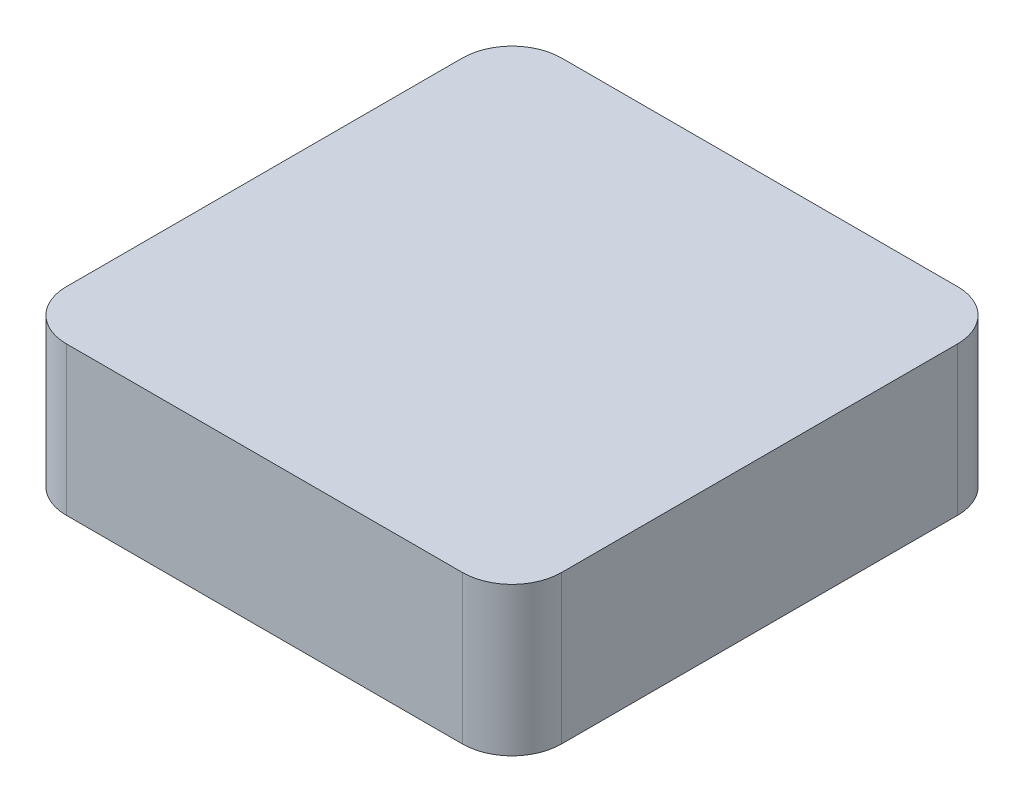
ISO-10303-21;
HEADER;
FILE_DESCRIPTION(('STEP AP214'),'2;1');
FILE_NAME('part.step','',(''),(''),'','','');
FILE_SCHEMA(('AUTOMOTIVE_DESIGN { 1 0 10303 214 1 1 1 1 }'));
ENDSEC;
DATA;
#1=APPLICATION_CONTEXT('core data for automotive mechanical design processes');
#2=APPLICATION_PROTOCOL_DEFINITION('international standard','automotive_design',2000,#1);
#3=PRODUCT_CONTEXT('',#1,'mechanical');
#4=PRODUCT('Part','Part','',(#3));
#5=PRODUCT_RELATED_PRODUCT_CATEGORY('part','',(#4));
#6=PRODUCT_DEFINITION_FORMATION('','',#4);
#7=PRODUCT_DEFINITION_CONTEXT('part definition',#1,'design');
#8=PRODUCT_DEFINITION('design','',#6,#7);
#9=PRODUCT_DEFINITION_SHAPE('','',#8);
#10=(LENGTH_UNIT() NAMED_UNIT(*) SI_UNIT(.MILLI.,.METRE.));
#11=(NAMED_UNIT(*) PLANE_ANGLE_UNIT() SI_UNIT($,.RADIAN.));
#12=(NAMED_UNIT(*) SI_UNIT($,.STERADIAN.) SOLID_ANGLE_UNIT());
#13=UNCERTAINTY_MEASURE_WITH_UNIT(LENGTH_MEASURE(1.E-05),#10,'distance_accuracy_value','');
#14=(GEOMETRIC_REPRESENTATION_CONTEXT(3) GLOBAL_UNCERTAINTY_ASSIGNED_CONTEXT((#13)) GLOBAL_UNIT_ASSIGNED_CONTEXT((#10,
#11,#12)) REPRESENTATION_CONTEXT('',''));
#15=CARTESIAN_POINT('',(0.,0.,0.));
#16=DIRECTION('',(0.,0.,1.));
#17=DIRECTION('',(1.,0.,0.));
#18=AXIS2_PLACEMENT_3D('',#15,#16,#17);
#19=CARTESIAN_POINT('',(50.8,38.1,-50.8));
#20=DIRECTION('',(0.,-1.,0.));
#21=DIRECTION('',(0.,0.,-1.));
#22=AXIS2_PLACEMENT_3D('',#19,#20,#21);
#23=CYLINDRICAL_SURFACE('',#22,12.7);
#24=CARTESIAN_POINT('',(50.8,0.,-50.8));
#25=DIRECTION('',(0.,1.,0.));
#26=DIRECTION('',(0.,0.,-1.));
#27=AXIS2_PLACEMENT_3D('',#24,#25,#26);
#28=CIRCLE('',#27,12.7);
#29=CARTESIAN_POINT('',(63.5,0.,-50.8));
#30=VERTEX_POINT('',#29);
#31=CARTESIAN_POINT('',(50.8,0.,-63.5));
#32=VERTEX_POINT('',#31);
#33=EDGE_CURVE('E129',#30,#32,#28,.T.);
#34=ORIENTED_EDGE('',*,*,#33,.T.);
#35=DIRECTION('',(0.,-1.,0.));
#36=VECTOR('',#35,1.);
#37=CARTESIAN_POINT('',(50.8,38.1,-63.5));
#38=LINE('',#37,#36);
#39=CARTESIAN_POINT('',(50.8,38.1,-63.5));
#40=VERTEX_POINT('',#39);
#41=EDGE_CURVE('E11',#40,#32,#38,.T.);
#42=ORIENTED_EDGE('',*,*,#41,.F.);
#43=CARTESIAN_POINT('',(50.8,38.1,-50.8));
#44=DIRECTION('',(0.,1.,0.));
#45=DIRECTION('',(0.,0.,-1.));
#46=AXIS2_PLACEMENT_3D('',#43,#44,#45);
#47=CIRCLE('',#46,12.7);
#48=CARTESIAN_POINT('',(63.5,38.1,-50.8));
#49=VERTEX_POINT('',#48);
#50=EDGE_CURVE('E143',#49,#40,#47,.T.);
#51=ORIENTED_EDGE('',*,*,#50,.F.);
#52=DIRECTION('',(0.,-1.,0.));
#53=VECTOR('',#52,1.);
#54=CARTESIAN_POINT('',(63.5,38.1,-50.8));
#55=LINE('',#54,#53);
#56=EDGE_CURVE('E125',#49,#30,#55,.T.);
#57=ORIENTED_EDGE('',*,*,#56,.T.);
#58=EDGE_LOOP('',(#34,#42,#51,#57));
#59=FACE_BOUND('',#58,.T.);
#60=ADVANCED_FACE('F33',(#59),#23,.T.);
#61=CARTESIAN_POINT('',(-50.8,38.1,-63.5));
#62=DIRECTION('',(0.,0.,1.));
#63=DIRECTION('',(1.,0.,0.));
#64=AXIS2_PLACEMENT_3D('',#61,#62,#63);
#65=PLANE('',#64);
#66=DIRECTION('',(-1.,0.,0.));
#67=VECTOR('',#66,1.);
#68=CARTESIAN_POINT('',(-50.8,0.,-63.5));
#69=LINE('',#68,#67);
#70=CARTESIAN_POINT('',(-50.8,0.,-63.5));
#71=VERTEX_POINT('',#70);
#72=EDGE_CURVE('E132',#32,#71,#69,.T.);
#73=ORIENTED_EDGE('',*,*,#72,.T.);
#74=DIRECTION('',(0.,-1.,0.));
#75=VECTOR('',#74,1.);
#76=CARTESIAN_POINT('',(-50.8,38.1,-63.5));
#77=LINE('',#76,#75);
#78=CARTESIAN_POINT('',(-50.8,38.1,-63.5));
#79=VERTEX_POINT('',#78);
#80=EDGE_CURVE('E41',#79,#71,#77,.T.);
#81=ORIENTED_EDGE('',*,*,#80,.F.);
#82=DIRECTION('',(-1.,0.,0.));
#83=VECTOR('',#82,1.);
#84=CARTESIAN_POINT('',(-50.8,38.1,-63.5));
#85=LINE('',#84,#83);
#86=EDGE_CURVE('E92',#40,#79,#85,.T.);
#87=ORIENTED_EDGE('',*,*,#86,.F.);
#88=ORIENTED_EDGE('',*,*,#41,.T.);
#89=EDGE_LOOP('',(#73,#81,#87,#88));
#90=FACE_BOUND('',#89,.T.);
#91=ADVANCED_FACE('F178',(#90),#65,.F.);
#92=CARTESIAN_POINT('',(-50.8,38.1,-50.8));
#93=DIRECTION('',(0.,-1.,0.));
#94=DIRECTION('',(0.,0.,-1.));
#95=AXIS2_PLACEMENT_3D('',#92,#93,#94);
#96=CYLINDRICAL_SURFACE('',#95,12.7);
#97=CARTESIAN_POINT('',(-50.8,0.,-50.8));
#98=DIRECTION('',(0.,1.,0.));
#99=DIRECTION('',(0.,0.,-1.));
#100=AXIS2_PLACEMENT_3D('',#97,#98,#99);
#101=CIRCLE('',#100,12.7);
#102=CARTESIAN_POINT('',(-63.5,0.,-50.8));
#103=VERTEX_POINT('',#102);
#104=EDGE_CURVE('E134',#71,#103,#101,.T.);
#105=ORIENTED_EDGE('',*,*,#104,.T.);
#106=DIRECTION('',(0.,-1.,0.));
#107=VECTOR('',#106,1.);
#108=CARTESIAN_POINT('',(-63.5,38.1,-50.8));
#109=LINE('',#108,#107);
#110=CARTESIAN_POINT('',(-63.5,38.1,-50.8));
#111=VERTEX_POINT('',#110);
#112=EDGE_CURVE('E150',#111,#103,#109,.T.);
#113=ORIENTED_EDGE('',*,*,#112,.F.);
#114=CARTESIAN_POINT('',(-50.8,38.1,-50.8));
#115=DIRECTION('',(0.,1.,0.));
#116=DIRECTION('',(0.,0.,-1.));
#117=AXIS2_PLACEMENT_3D('',#114,#115,#116);
#118=CIRCLE('',#117,12.7);
#119=EDGE_CURVE('E158',#79,#111,#118,.T.);
#120=ORIENTED_EDGE('',*,*,#119,.F.);
#121=ORIENTED_EDGE('',*,*,#80,.T.);
#122=EDGE_LOOP('',(#105,#113,#120,#121));
#123=FACE_BOUND('',#122,.T.);
#124=ADVANCED_FACE('F156',(#123),#96,.T.);
#125=CARTESIAN_POINT('',(-63.5,38.1,50.8));
#126=DIRECTION('',(1.,0.,0.));
#127=DIRECTION('',(0.,0.,-1.));
#128=AXIS2_PLACEMENT_3D('',#125,#126,#127);
#129=PLANE('',#128);
#130=DIRECTION('',(0.,0.,1.));
#131=VECTOR('',#130,1.);
#132=CARTESIAN_POINT('',(-63.5,0.,50.8));
#133=LINE('',#132,#131);
#134=CARTESIAN_POINT('',(-63.5,0.,50.8));
#135=VERTEX_POINT('',#134);
#136=EDGE_CURVE('E136',#103,#135,#133,.T.);
#137=ORIENTED_EDGE('',*,*,#136,.T.);
#138=DIRECTION('',(0.,-1.,0.));
#139=VECTOR('',#138,1.);
#140=CARTESIAN_POINT('',(-63.5,38.1,50.8));
#141=LINE('',#140,#139);
#142=CARTESIAN_POINT('',(-63.5,38.1,50.8));
#143=VERTEX_POINT('',#142);
#144=EDGE_CURVE('E147',#143,#135,#141,.T.);
#145=ORIENTED_EDGE('',*,*,#144,.F.);
#146=DIRECTION('',(0.,0.,1.));
#147=VECTOR('',#146,1.);
#148=CARTESIAN_POINT('',(-63.5,38.1,50.8));
#149=LINE('',#148,#147);
#150=EDGE_CURVE('E170',#111,#143,#149,.T.);
#151=ORIENTED_EDGE('',*,*,#150,.F.);
#152=ORIENTED_EDGE('',*,*,#112,.T.);
#153=EDGE_LOOP('',(#137,#145,#151,#152));
#154=FACE_BOUND('',#153,.T.);
#155=ADVANCED_FACE('F166',(#154),#129,.F.);
#156=CARTESIAN_POINT('',(-50.8,38.1,50.8));
#157=DIRECTION('',(0.,-1.,0.));
#158=DIRECTION('',(0.,0.,-1.));
#159=AXIS2_PLACEMENT_3D('',#156,#157,#158);
#160=CYLINDRICAL_SURFACE('',#159,12.7);
#161=CARTESIAN_POINT('',(-50.8,0.,50.8));
#162=DIRECTION('',(0.,1.,0.));
#163=DIRECTION('',(0.,0.,-1.));
#164=AXIS2_PLACEMENT_3D('',#161,#162,#163);
#165=CIRCLE('',#164,12.7);
#166=CARTESIAN_POINT('',(-50.8,0.,63.5));
#167=VERTEX_POINT('',#166);
#168=EDGE_CURVE('E138',#135,#167,#165,.T.);
#169=ORIENTED_EDGE('',*,*,#168,.T.);
#170=DIRECTION('',(0.,-1.,0.));
#171=VECTOR('',#170,1.);
#172=CARTESIAN_POINT('',(-50.8,38.1,63.5));
#173=LINE('',#172,#171);
#174=CARTESIAN_POINT('',(-50.8,38.1,63.5));
#175=VERTEX_POINT('',#174);
#176=EDGE_CURVE('E120',#175,#167,#173,.T.);
#177=ORIENTED_EDGE('',*,*,#176,.F.);
#178=CARTESIAN_POINT('',(-50.8,38.1,50.8));
#179=DIRECTION('',(0.,1.,0.));
#180=DIRECTION('',(0.,0.,-1.));
#181=AXIS2_PLACEMENT_3D('',#178,#179,#180);
#182=CIRCLE('',#181,12.7);
#183=EDGE_CURVE('E111',#143,#175,#182,.T.);
#184=ORIENTED_EDGE('',*,*,#183,.F.);
#185=ORIENTED_EDGE('',*,*,#144,.T.);
#186=EDGE_LOOP('',(#169,#177,#184,#185));
#187=FACE_BOUND('',#186,.T.);
#188=ADVANCED_FACE('F169',(#187),#160,.T.);
#189=CARTESIAN_POINT('',(-50.8,38.1,63.5));
#190=DIRECTION('',(0.,0.,-1.));
#191=DIRECTION('',(-1.,0.,0.));
#192=AXIS2_PLACEMENT_3D('',#189,#190,#191);
#193=PLANE('',#192);
#194=DIRECTION('',(1.,0.,0.));
#195=VECTOR('',#194,1.);
#196=CARTESIAN_POINT('',(-50.8,0.,63.5));
#197=LINE('',#196,#195);
#198=CARTESIAN_POINT('',(50.8,0.,63.5));
#199=VERTEX_POINT('',#198);
#200=EDGE_CURVE('E119',#167,#199,#197,.T.);
#201=ORIENTED_EDGE('',*,*,#200,.T.);
#202=DIRECTION('',(0.,-1.,0.));
#203=VECTOR('',#202,1.);
#204=CARTESIAN_POINT('',(50.8,38.1,63.5));
#205=LINE('',#204,#203);
#206=CARTESIAN_POINT('',(50.8,38.1,63.5));
#207=VERTEX_POINT('',#206);
#208=EDGE_CURVE('E116',#207,#199,#205,.T.);
#209=ORIENTED_EDGE('',*,*,#208,.F.);
#210=DIRECTION('',(1.,0.,0.));
#211=VECTOR('',#210,1.);
#212=CARTESIAN_POINT('',(-50.8,38.1,63.5));
#213=LINE('',#212,#211);
#214=EDGE_CURVE('E105',#175,#207,#213,.T.);
#215=ORIENTED_EDGE('',*,*,#214,.F.);
#216=ORIENTED_EDGE('',*,*,#176,.T.);
#217=EDGE_LOOP('',(#201,#209,#215,#216));
#218=FACE_BOUND('',#217,.T.);
#219=ADVANCED_FACE('F117',(#218),#193,.F.);
#220=CARTESIAN_POINT('',(50.8,38.1,50.8));
#221=DIRECTION('',(0.,-1.,0.));
#222=DIRECTION('',(0.,0.,-1.));
#223=AXIS2_PLACEMENT_3D('',#220,#221,#222);
#224=CYLINDRICAL_SURFACE('',#223,12.7);
#225=CARTESIAN_POINT('',(50.8,0.,50.8));
#226=DIRECTION('',(0.,1.,0.));
#227=DIRECTION('',(0.,0.,1.));
#228=AXIS2_PLACEMENT_3D('',#225,#226,#227);
#229=CIRCLE('',#228,12.7);
#230=CARTESIAN_POINT('',(63.5,0.,50.8));
#231=VERTEX_POINT('',#230);
#232=EDGE_CURVE('E78',#199,#231,#229,.T.);
#233=ORIENTED_EDGE('',*,*,#232,.T.);
#234=DIRECTION('',(0.,-1.,0.));
#235=VECTOR('',#234,1.);
#236=CARTESIAN_POINT('',(63.5,38.1,50.8));
#237=LINE('',#236,#235);
#238=CARTESIAN_POINT('',(63.5,38.1,50.8));
#239=VERTEX_POINT('',#238);
#240=EDGE_CURVE('E121',#239,#231,#237,.T.);
#241=ORIENTED_EDGE('',*,*,#240,.F.);
#242=CARTESIAN_POINT('',(50.8,38.1,50.8));
#243=DIRECTION('',(0.,1.,0.));
#244=DIRECTION('',(0.,0.,1.));
#245=AXIS2_PLACEMENT_3D('',#242,#243,#244);
#246=CIRCLE('',#245,12.7);
#247=EDGE_CURVE('E109',#207,#239,#246,.T.);
#248=ORIENTED_EDGE('',*,*,#247,.F.);
#249=ORIENTED_EDGE('',*,*,#208,.T.);
#250=EDGE_LOOP('',(#233,#241,#248,#249));
#251=FACE_BOUND('',#250,.T.);
#252=ADVANCED_FACE('F123',(#251),#224,.T.);
#253=CARTESIAN_POINT('',(63.5,38.1,50.8));
#254=DIRECTION('',(-1.,0.,0.));
#255=DIRECTION('',(0.,0.,1.));
#256=AXIS2_PLACEMENT_3D('',#253,#254,#255);
#257=PLANE('',#256);
#258=DIRECTION('',(0.,0.,-1.));
#259=VECTOR('',#258,1.);
#260=CARTESIAN_POINT('',(63.5,0.,50.8));
#261=LINE('',#260,#259);
#262=EDGE_CURVE('E84',#231,#30,#261,.T.);
#263=ORIENTED_EDGE('',*,*,#262,.T.);
#264=ORIENTED_EDGE('',*,*,#56,.F.);
#265=DIRECTION('',(0.,0.,-1.));
#266=VECTOR('',#265,1.);
#267=CARTESIAN_POINT('',(63.5,38.1,50.8));
#268=LINE('',#267,#266);
#269=EDGE_CURVE('E49',#239,#49,#268,.T.);
#270=ORIENTED_EDGE('',*,*,#269,.F.);
#271=ORIENTED_EDGE('',*,*,#240,.T.);
#272=EDGE_LOOP('',(#263,#264,#270,#271));
#273=FACE_BOUND('',#272,.T.);
#274=ADVANCED_FACE('F194',(#273),#257,.F.);
#275=CARTESIAN_POINT('',(50.8,38.1,-50.8));
#276=DIRECTION('',(0.,-1.,0.));
#277=DIRECTION('',(0.,0.,-1.));
#278=AXIS2_PLACEMENT_3D('',#275,#276,#277);
#279=PLANE('',#278);
#280=ORIENTED_EDGE('',*,*,#50,.T.);
#281=ORIENTED_EDGE('',*,*,#86,.T.);
#282=ORIENTED_EDGE('',*,*,#119,.T.);
#283=ORIENTED_EDGE('',*,*,#150,.T.);
#284=ORIENTED_EDGE('',*,*,#183,.T.);
#285=ORIENTED_EDGE('',*,*,#214,.T.);
#286=ORIENTED_EDGE('',*,*,#247,.T.);
#287=ORIENTED_EDGE('',*,*,#269,.T.);
#288=EDGE_LOOP('',(#280,#281,#282,#283,#284,#285,#286,#287));
#289=FACE_BOUND('',#288,.T.);
#290=ADVANCED_FACE('F107',(#289),#279,.F.);
#291=CARTESIAN_POINT('',(50.8,0.,-50.8));
#292=DIRECTION('',(0.,-1.,0.));
#293=DIRECTION('',(0.,0.,-1.));
#294=AXIS2_PLACEMENT_3D('',#291,#292,#293);
#295=PLANE('',#294);
#296=ORIENTED_EDGE('',*,*,#33,.F.);
#297=ORIENTED_EDGE('',*,*,#262,.F.);
#298=ORIENTED_EDGE('',*,*,#232,.F.);
#299=ORIENTED_EDGE('',*,*,#200,.F.);
#300=ORIENTED_EDGE('',*,*,#168,.F.);
#301=ORIENTED_EDGE('',*,*,#136,.F.);
#302=ORIENTED_EDGE('',*,*,#104,.F.);
#303=ORIENTED_EDGE('',*,*,#72,.F.);
#304=EDGE_LOOP('',(#296,#297,#298,#299,#300,#301,#302,#303));
#305=FACE_BOUND('',#304,.T.);
#306=ADVANCED_FACE('F162',(#305),#295,.T.);
#307=CLOSED_SHELL('',(#60,#91,#124,#155,#188,#219,#252,#274,#290,#306));
#308=MANIFOLD_SOLID_BREP('B2',#307);
#309=ADVANCED_BREP_SHAPE_REPRESENTATION('',(#18,#308),#14);
#310=SHAPE_DEFINITION_REPRESENTATION(#9,#309);
ENDSEC;
END-ISO-10303-21;
